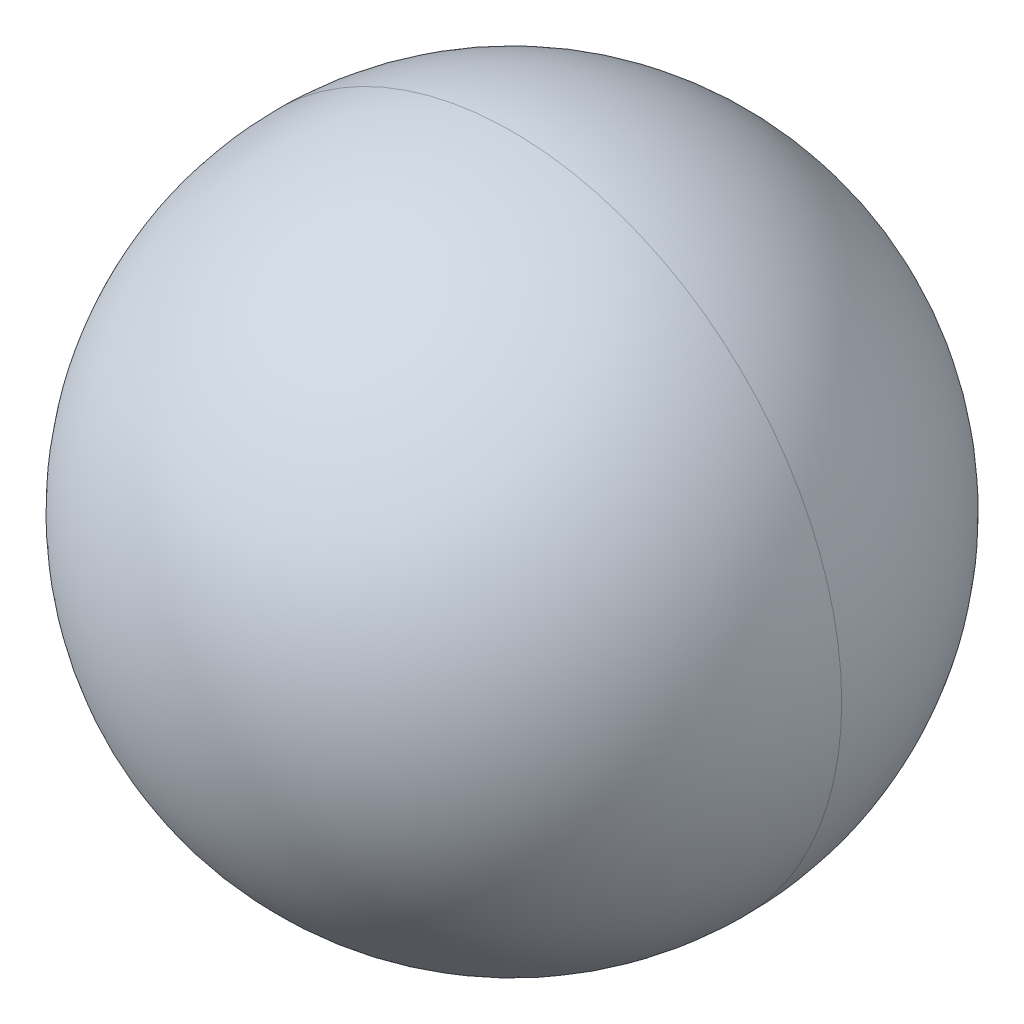
ISO-10303-21;
HEADER;
FILE_DESCRIPTION(('STEP AP214'),'2;1');
FILE_NAME('part.step','',(''),(''),'','','');
FILE_SCHEMA(('AUTOMOTIVE_DESIGN { 1 0 10303 214 1 1 1 1 }'));
ENDSEC;
DATA;
#1=APPLICATION_CONTEXT('core data for automotive mechanical design processes');
#2=APPLICATION_PROTOCOL_DEFINITION('international standard','automotive_design',2000,#1);
#3=PRODUCT_CONTEXT('',#1,'mechanical');
#4=PRODUCT('Part','Part','',(#3));
#5=PRODUCT_RELATED_PRODUCT_CATEGORY('part','',(#4));
#6=PRODUCT_DEFINITION_FORMATION('','',#4);
#7=PRODUCT_DEFINITION_CONTEXT('part definition',#1,'design');
#8=PRODUCT_DEFINITION('design','',#6,#7);
#9=PRODUCT_DEFINITION_SHAPE('','',#8);
#10=(LENGTH_UNIT() NAMED_UNIT(*) SI_UNIT(.MILLI.,.METRE.));
#11=(NAMED_UNIT(*) PLANE_ANGLE_UNIT() SI_UNIT($,.RADIAN.));
#12=(NAMED_UNIT(*) SI_UNIT($,.STERADIAN.) SOLID_ANGLE_UNIT());
#13=UNCERTAINTY_MEASURE_WITH_UNIT(LENGTH_MEASURE(1.E-05),#10,'distance_accuracy_value','');
#14=(GEOMETRIC_REPRESENTATION_CONTEXT(3) GLOBAL_UNCERTAINTY_ASSIGNED_CONTEXT((#13)) GLOBAL_UNIT_ASSIGNED_CONTEXT((#10,
#11,#12)) REPRESENTATION_CONTEXT('',''));
#15=CARTESIAN_POINT('',(0.,0.,0.));
#16=DIRECTION('',(0.,0.,1.));
#17=DIRECTION('',(1.,0.,0.));
#18=AXIS2_PLACEMENT_3D('',#15,#16,#17);
#19=CARTESIAN_POINT('',(10.,35.,0.));
#20=DIRECTION('',(1.,0.,0.));
#21=DIRECTION('',(0.,0.,1.));
#22=AXIS2_PLACEMENT_3D('',#19,#20,#21);
#23=SPHERICAL_SURFACE('',#22,6.35);
#24=CARTESIAN_POINT('',(10.,35.,0.));
#25=DIRECTION('',(0.,0.,-1.));
#26=DIRECTION('',(1.,0.,0.));
#27=AXIS2_PLACEMENT_3D('',#24,#25,#26);
#28=CIRCLE('',#27,6.35);
#29=CARTESIAN_POINT('',(16.35,35.,0.));
#30=VERTEX_POINT('',#29);
#31=CARTESIAN_POINT('',(3.65,35.,0.));
#32=VERTEX_POINT('',#31);
#33=EDGE_CURVE('E11',#30,#32,#28,.T.);
#34=ORIENTED_EDGE('',*,*,#33,.T.);
#35=CARTESIAN_POINT('',(10.,35.,0.));
#36=DIRECTION('',(0.,0.,1.));
#37=DIRECTION('',(1.,0.,0.));
#38=AXIS2_PLACEMENT_3D('',#35,#36,#37);
#39=CIRCLE('',#38,6.35);
#40=EDGE_CURVE('E25',#30,#32,#39,.T.);
#41=ORIENTED_EDGE('',*,*,#40,.F.);
#42=EDGE_LOOP('',(#34,#41));
#43=FACE_BOUND('',#42,.T.);
#44=ADVANCED_FACE('F17',(#43),#23,.T.);
#45=CARTESIAN_POINT('',(10.,35.,0.));
#46=DIRECTION('',(1.,0.,0.));
#47=DIRECTION('',(0.,0.,-1.));
#48=AXIS2_PLACEMENT_3D('',#45,#46,#47);
#49=SPHERICAL_SURFACE('',#48,6.35);
#50=ORIENTED_EDGE('',*,*,#33,.F.);
#51=ORIENTED_EDGE('',*,*,#40,.T.);
#52=EDGE_LOOP('',(#50,#51));
#53=FACE_BOUND('',#52,.T.);
#54=ADVANCED_FACE('F33',(#53),#49,.T.);
#55=CLOSED_SHELL('',(#44,#54));
#56=MANIFOLD_SOLID_BREP('B1',#55);
#57=ADVANCED_BREP_SHAPE_REPRESENTATION('',(#18,#56),#14);
#58=SHAPE_DEFINITION_REPRESENTATION(#9,#57);
ENDSEC;
END-ISO-10303-21;
